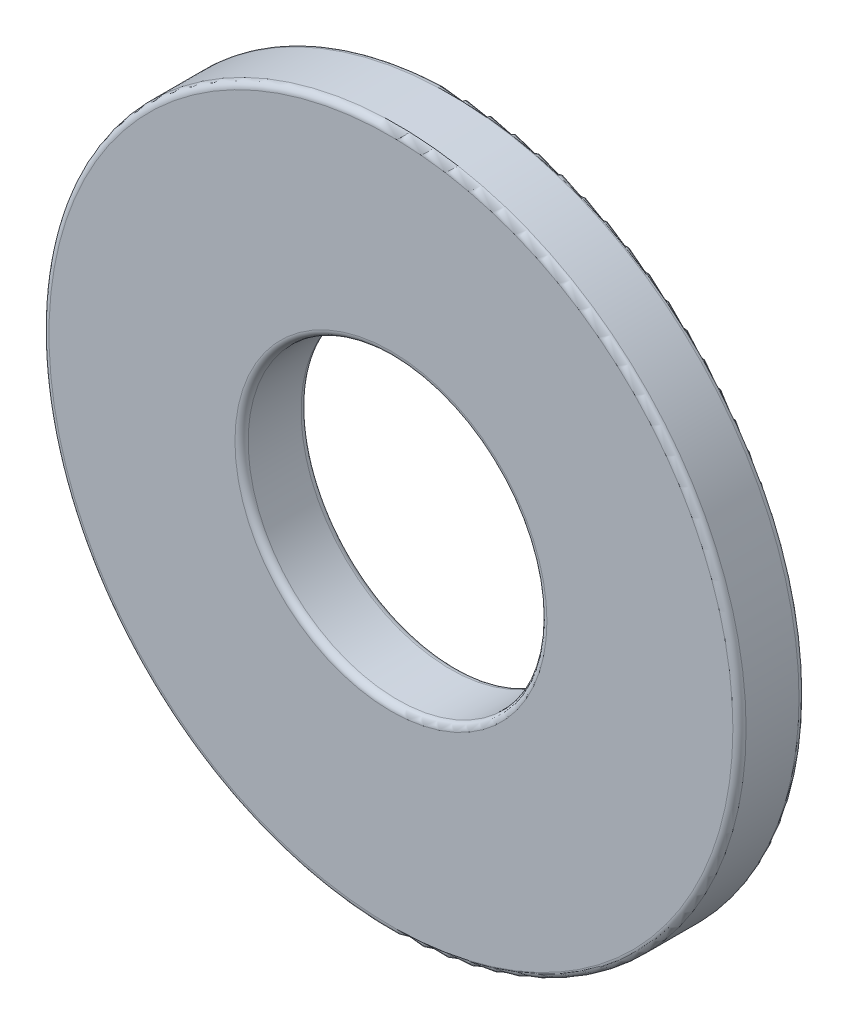
ISO-10303-21;
HEADER;
FILE_DESCRIPTION(('STEP AP214'),'2;1');
FILE_NAME('part.step','',(''),(''),'','','');
FILE_SCHEMA(('AUTOMOTIVE_DESIGN { 1 0 10303 214 1 1 1 1 }'));
ENDSEC;
DATA;
#1=APPLICATION_CONTEXT('core data for automotive mechanical design processes');
#2=APPLICATION_PROTOCOL_DEFINITION('international standard','automotive_design',2000,#1);
#3=PRODUCT_CONTEXT('',#1,'mechanical');
#4=PRODUCT('Part','Part','',(#3));
#5=PRODUCT_RELATED_PRODUCT_CATEGORY('part','',(#4));
#6=PRODUCT_DEFINITION_FORMATION('','',#4);
#7=PRODUCT_DEFINITION_CONTEXT('part definition',#1,'design');
#8=PRODUCT_DEFINITION('design','',#6,#7);
#9=PRODUCT_DEFINITION_SHAPE('','',#8);
#10=(LENGTH_UNIT() NAMED_UNIT(*) SI_UNIT(.MILLI.,.METRE.));
#11=(NAMED_UNIT(*) PLANE_ANGLE_UNIT() SI_UNIT($,.RADIAN.));
#12=(NAMED_UNIT(*) SI_UNIT($,.STERADIAN.) SOLID_ANGLE_UNIT());
#13=UNCERTAINTY_MEASURE_WITH_UNIT(LENGTH_MEASURE(1.E-05),#10,'distance_accuracy_value','');
#14=(GEOMETRIC_REPRESENTATION_CONTEXT(3) GLOBAL_UNCERTAINTY_ASSIGNED_CONTEXT((#13)) GLOBAL_UNIT_ASSIGNED_CONTEXT((#10,
#11,#12)) REPRESENTATION_CONTEXT('',''));
#15=CARTESIAN_POINT('',(0.,0.,0.));
#16=DIRECTION('',(0.,0.,1.));
#17=DIRECTION('',(1.,0.,0.));
#18=AXIS2_PLACEMENT_3D('',#15,#16,#17);
#19=CARTESIAN_POINT('',(0.,0.,-1.0541));
#20=DIRECTION('',(0.,0.,1.));
#21=DIRECTION('',(1.,0.,0.));
#22=AXIS2_PLACEMENT_3D('',#19,#20,#21);
#23=CYLINDRICAL_SURFACE('',#22,11.1125);
#24=CARTESIAN_POINT('',(0.,0.,-0.84328));
#25=DIRECTION('',(0.,0.,1.));
#26=DIRECTION('',(1.,0.,0.));
#27=AXIS2_PLACEMENT_3D('',#24,#25,#26);
#28=CIRCLE('',#27,11.1125);
#29=CARTESIAN_POINT('',(11.1125,0.,-0.84328));
#30=VERTEX_POINT('',#29);
#31=EDGE_CURVE('E58',#30,#30,#28,.T.);
#32=ORIENTED_EDGE('',*,*,#31,.T.);
#33=EDGE_LOOP('',(#32));
#34=FACE_BOUND('',#33,.T.);
#35=CARTESIAN_POINT('',(0.,0.,0.84328));
#36=DIRECTION('',(0.,0.,1.));
#37=DIRECTION('',(1.,0.,0.));
#38=AXIS2_PLACEMENT_3D('',#35,#36,#37);
#39=CIRCLE('',#38,11.1125);
#40=CARTESIAN_POINT('',(11.1125,0.,0.84328));
#41=VERTEX_POINT('',#40);
#42=EDGE_CURVE('E61',#41,#41,#39,.F.);
#43=ORIENTED_EDGE('',*,*,#42,.T.);
#44=EDGE_LOOP('',(#43));
#45=FACE_BOUND('',#44,.T.);
#46=ADVANCED_FACE('F32',(#34,#45),#23,.T.);
#47=CARTESIAN_POINT('',(0.,0.,-1.0541));
#48=DIRECTION('',(0.,0.,1.));
#49=DIRECTION('',(1.,0.,0.));
#50=AXIS2_PLACEMENT_3D('',#47,#48,#49);
#51=PLANE('',#50);
#52=CARTESIAN_POINT('',(0.,0.,-1.0541));
#53=DIRECTION('',(0.,0.,1.));
#54=DIRECTION('',(1.,0.,0.));
#55=AXIS2_PLACEMENT_3D('',#52,#53,#54);
#56=CIRCLE('',#55,10.90168);
#57=CARTESIAN_POINT('',(10.90168,0.,-1.0541));
#58=VERTEX_POINT('',#57);
#59=EDGE_CURVE('E52',#58,#58,#56,.F.);
#60=ORIENTED_EDGE('',*,*,#59,.T.);
#61=EDGE_LOOP('',(#60));
#62=FACE_BOUND('',#61,.T.);
#63=CARTESIAN_POINT('',(0.,0.,-1.0541));
#64=DIRECTION('',(0.,0.,1.));
#65=DIRECTION('',(1.,0.,0.));
#66=AXIS2_PLACEMENT_3D('',#63,#64,#65);
#67=CIRCLE('',#66,4.97332);
#68=CARTESIAN_POINT('',(4.97332,0.,-1.0541));
#69=VERTEX_POINT('',#68);
#70=EDGE_CURVE('E55',#69,#69,#67,.T.);
#71=ORIENTED_EDGE('',*,*,#70,.T.);
#72=EDGE_LOOP('',(#71));
#73=FACE_BOUND('',#72,.T.);
#74=ADVANCED_FACE('F75',(#62,#73),#51,.F.);
#75=CARTESIAN_POINT('',(0.,0.,-1.0541));
#76=DIRECTION('',(0.,0.,1.));
#77=DIRECTION('',(1.,0.,0.));
#78=AXIS2_PLACEMENT_3D('',#75,#76,#77);
#79=CYLINDRICAL_SURFACE('',#78,4.7625);
#80=CARTESIAN_POINT('',(0.,0.,-0.84328));
#81=DIRECTION('',(0.,0.,1.));
#82=DIRECTION('',(1.,0.,0.));
#83=AXIS2_PLACEMENT_3D('',#80,#81,#82);
#84=CIRCLE('',#83,4.7625);
#85=CARTESIAN_POINT('',(4.7625,0.,-0.84328));
#86=VERTEX_POINT('',#85);
#87=EDGE_CURVE('E43',#86,#86,#84,.F.);
#88=ORIENTED_EDGE('',*,*,#87,.T.);
#89=EDGE_LOOP('',(#88));
#90=FACE_BOUND('',#89,.T.);
#91=CARTESIAN_POINT('',(0.,0.,0.84328));
#92=DIRECTION('',(0.,0.,1.));
#93=DIRECTION('',(1.,0.,0.));
#94=AXIS2_PLACEMENT_3D('',#91,#92,#93);
#95=CIRCLE('',#94,4.7625);
#96=CARTESIAN_POINT('',(4.7625,0.,0.84328));
#97=VERTEX_POINT('',#96);
#98=EDGE_CURVE('E47',#97,#97,#95,.T.);
#99=ORIENTED_EDGE('',*,*,#98,.T.);
#100=EDGE_LOOP('',(#99));
#101=FACE_BOUND('',#100,.T.);
#102=ADVANCED_FACE('F81',(#90,#101),#79,.F.);
#103=CARTESIAN_POINT('',(0.,0.,1.0541));
#104=DIRECTION('',(0.,0.,1.));
#105=DIRECTION('',(1.,0.,0.));
#106=AXIS2_PLACEMENT_3D('',#103,#104,#105);
#107=PLANE('',#106);
#108=CARTESIAN_POINT('',(0.,0.,1.0541));
#109=DIRECTION('',(0.,0.,1.));
#110=DIRECTION('',(1.,0.,0.));
#111=AXIS2_PLACEMENT_3D('',#108,#109,#110);
#112=CIRCLE('',#111,4.97332);
#113=CARTESIAN_POINT('',(4.97332,0.,1.0541));
#114=VERTEX_POINT('',#113);
#115=EDGE_CURVE('E10',#114,#114,#112,.F.);
#116=ORIENTED_EDGE('',*,*,#115,.T.);
#117=EDGE_LOOP('',(#116));
#118=FACE_BOUND('',#117,.T.);
#119=CARTESIAN_POINT('',(0.,0.,1.0541));
#120=DIRECTION('',(0.,0.,1.));
#121=DIRECTION('',(1.,0.,0.));
#122=AXIS2_PLACEMENT_3D('',#119,#120,#121);
#123=CIRCLE('',#122,10.90168);
#124=CARTESIAN_POINT('',(10.90168,0.,1.0541));
#125=VERTEX_POINT('',#124);
#126=EDGE_CURVE('E39',#125,#125,#123,.T.);
#127=ORIENTED_EDGE('',*,*,#126,.T.);
#128=EDGE_LOOP('',(#127));
#129=FACE_BOUND('',#128,.T.);
#130=ADVANCED_FACE('F89',(#118,#129),#107,.T.);
#131=CARTESIAN_POINT('',(0.,0.,-0.84328));
#132=DIRECTION('',(0.,0.,1.));
#133=DIRECTION('',(1.,0.,0.));
#134=AXIS2_PLACEMENT_3D('',#131,#132,#133);
#135=TOROIDAL_SURFACE('',#134,10.90168,0.21082);
#136=ORIENTED_EDGE('',*,*,#59,.F.);
#137=EDGE_LOOP('',(#136));
#138=FACE_BOUND('',#137,.T.);
#139=ORIENTED_EDGE('',*,*,#31,.F.);
#140=EDGE_LOOP('',(#139));
#141=FACE_BOUND('',#140,.T.);
#142=ADVANCED_FACE('F86',(#138,#141),#135,.T.);
#143=CARTESIAN_POINT('',(0.,0.,-0.84328));
#144=DIRECTION('',(0.,0.,1.));
#145=DIRECTION('',(1.,0.,0.));
#146=AXIS2_PLACEMENT_3D('',#143,#144,#145);
#147=TOROIDAL_SURFACE('',#146,4.97332,0.21082);
#148=ORIENTED_EDGE('',*,*,#87,.F.);
#149=EDGE_LOOP('',(#148));
#150=FACE_BOUND('',#149,.T.);
#151=ORIENTED_EDGE('',*,*,#70,.F.);
#152=EDGE_LOOP('',(#151));
#153=FACE_BOUND('',#152,.T.);
#154=ADVANCED_FACE('F72',(#150,#153),#147,.T.);
#155=CARTESIAN_POINT('',(0.,0.,0.84328));
#156=DIRECTION('',(0.,0.,1.));
#157=DIRECTION('',(1.,0.,0.));
#158=AXIS2_PLACEMENT_3D('',#155,#156,#157);
#159=TOROIDAL_SURFACE('',#158,4.97332,0.21082);
#160=ORIENTED_EDGE('',*,*,#115,.F.);
#161=EDGE_LOOP('',(#160));
#162=FACE_BOUND('',#161,.T.);
#163=ORIENTED_EDGE('',*,*,#98,.F.);
#164=EDGE_LOOP('',(#163));
#165=FACE_BOUND('',#164,.T.);
#166=ADVANCED_FACE('F68',(#162,#165),#159,.T.);
#167=CARTESIAN_POINT('',(0.,0.,0.84328));
#168=DIRECTION('',(0.,0.,1.));
#169=DIRECTION('',(1.,0.,0.));
#170=AXIS2_PLACEMENT_3D('',#167,#168,#169);
#171=TOROIDAL_SURFACE('',#170,10.90168,0.21082);
#172=ORIENTED_EDGE('',*,*,#42,.F.);
#173=EDGE_LOOP('',(#172));
#174=FACE_BOUND('',#173,.T.);
#175=ORIENTED_EDGE('',*,*,#126,.F.);
#176=EDGE_LOOP('',(#175));
#177=FACE_BOUND('',#176,.T.);
#178=ADVANCED_FACE('F34',(#174,#177),#171,.T.);
#179=CLOSED_SHELL('',(#46,#74,#102,#130,#142,#154,#166,#178));
#180=MANIFOLD_SOLID_BREP('B2',#179);
#181=ADVANCED_BREP_SHAPE_REPRESENTATION('',(#18,#180),#14);
#182=SHAPE_DEFINITION_REPRESENTATION(#9,#181);
ENDSEC;
END-ISO-10303-21;
